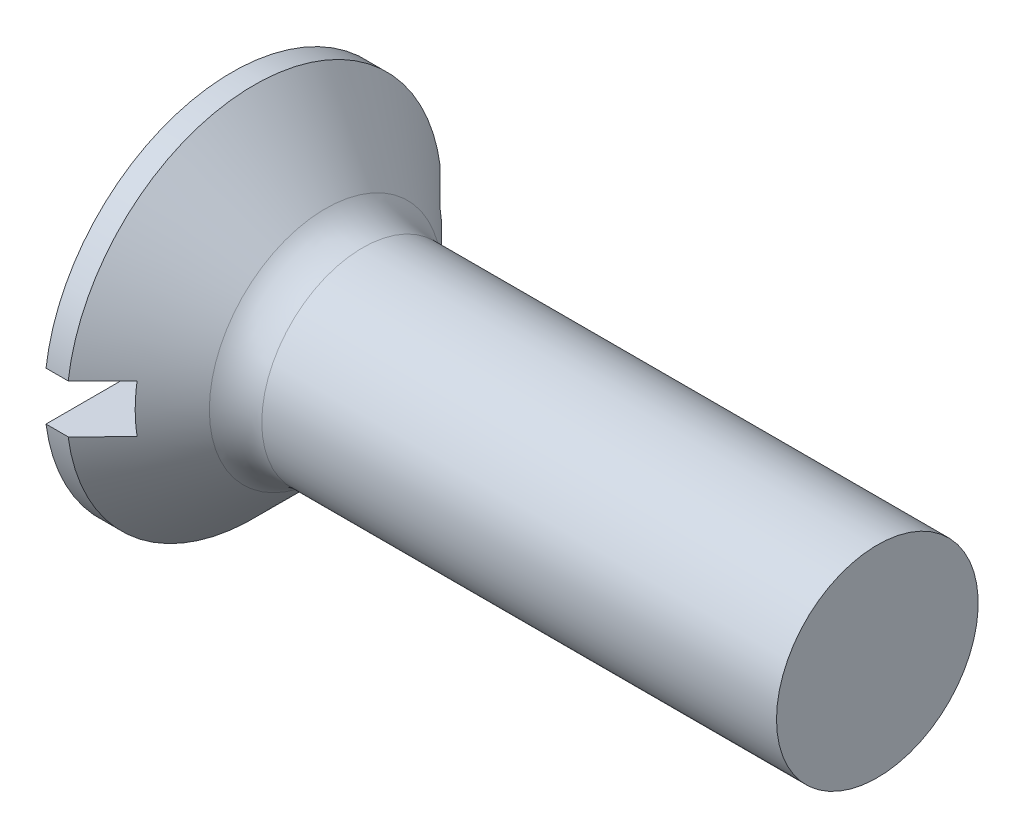
ISO-10303-21;
HEADER;
FILE_DESCRIPTION(('STEP AP214'),'2;1');
FILE_NAME('part.step','',(''),(''),'','','');
FILE_SCHEMA(('AUTOMOTIVE_DESIGN { 1 0 10303 214 1 1 1 1 }'));
ENDSEC;
DATA;
#1=APPLICATION_CONTEXT('core data for automotive mechanical design processes');
#2=APPLICATION_PROTOCOL_DEFINITION('international standard','automotive_design',2000,#1);
#3=PRODUCT_CONTEXT('',#1,'mechanical');
#4=PRODUCT('Part','Part','',(#3));
#5=PRODUCT_RELATED_PRODUCT_CATEGORY('part','',(#4));
#6=PRODUCT_DEFINITION_FORMATION('','',#4);
#7=PRODUCT_DEFINITION_CONTEXT('part definition',#1,'design');
#8=PRODUCT_DEFINITION('design','',#6,#7);
#9=PRODUCT_DEFINITION_SHAPE('','',#8);
#10=(LENGTH_UNIT() NAMED_UNIT(*) SI_UNIT(.MILLI.,.METRE.));
#11=(NAMED_UNIT(*) PLANE_ANGLE_UNIT() SI_UNIT($,.RADIAN.));
#12=(NAMED_UNIT(*) SI_UNIT($,.STERADIAN.) SOLID_ANGLE_UNIT());
#13=UNCERTAINTY_MEASURE_WITH_UNIT(LENGTH_MEASURE(1.E-05),#10,'distance_accuracy_value','');
#14=(GEOMETRIC_REPRESENTATION_CONTEXT(3) GLOBAL_UNCERTAINTY_ASSIGNED_CONTEXT((#13)) GLOBAL_UNIT_ASSIGNED_CONTEXT((#10,
#11,#12)) REPRESENTATION_CONTEXT('',''));
#15=CARTESIAN_POINT('',(0.,0.,0.));
#16=DIRECTION('',(0.,0.,1.));
#17=DIRECTION('',(1.,0.,0.));
#18=AXIS2_PLACEMENT_3D('',#15,#16,#17);
#19=CARTESIAN_POINT('',(-6.34999999999999,0.,0.));
#20=DIRECTION('',(-1.,0.,0.));
#21=DIRECTION('',(0.,0.,1.));
#22=AXIS2_PLACEMENT_3D('',#19,#20,#21);
#23=CYLINDRICAL_SURFACE('',#22,4.65);
#24=DIRECTION('',(-1.,0.,0.));
#25=VECTOR('',#24,1.);
#26=CARTESIAN_POINT('',(-6.34999999999999,0.599999999999999,-4.61112784468182));
#27=LINE('',#26,#25);
#28=CARTESIAN_POINT('',(0.,0.599999999999999,-4.61112784468182));
#29=VERTEX_POINT('',#28);
#30=CARTESIAN_POINT('',(0.550000000000009,0.599999999999999,-4.61112784468182));
#31=VERTEX_POINT('',#30);
#32=EDGE_CURVE('E53',#29,#31,#27,.F.);
#33=ORIENTED_EDGE('',*,*,#32,.F.);
#34=CARTESIAN_POINT('',(0.,0.,0.));
#35=DIRECTION('',(-1.,0.,0.));
#36=DIRECTION('',(0.,0.,1.));
#37=AXIS2_PLACEMENT_3D('',#34,#35,#36);
#38=CIRCLE('',#37,4.65);
#39=CARTESIAN_POINT('',(0.,0.600000000000001,4.61112784468182));
#40=VERTEX_POINT('',#39);
#41=EDGE_CURVE('E100',#40,#29,#38,.T.);
#42=ORIENTED_EDGE('',*,*,#41,.F.);
#43=DIRECTION('',(-1.,0.,0.));
#44=VECTOR('',#43,1.);
#45=CARTESIAN_POINT('',(-6.34999999999999,0.600000000000001,4.61112784468182));
#46=LINE('',#45,#44);
#47=CARTESIAN_POINT('',(0.550000000000009,0.600000000000001,4.61112784468182));
#48=VERTEX_POINT('',#47);
#49=EDGE_CURVE('E141',#48,#40,#46,.T.);
#50=ORIENTED_EDGE('',*,*,#49,.F.);
#51=CARTESIAN_POINT('',(0.550000000000008,0.,0.));
#52=DIRECTION('',(-1.,0.,0.));
#53=DIRECTION('',(0.,0.,1.));
#54=AXIS2_PLACEMENT_3D('',#51,#52,#53);
#55=CIRCLE('',#54,4.65);
#56=EDGE_CURVE('E109',#48,#31,#55,.T.);
#57=ORIENTED_EDGE('',*,*,#56,.T.);
#58=EDGE_LOOP('',(#33,#42,#50,#57));
#59=FACE_BOUND('',#58,.T.);
#60=ADVANCED_FACE('F30',(#59),#23,.T.);
#61=CARTESIAN_POINT('',(0.,0.,0.));
#62=DIRECTION('',(-1.,0.,0.));
#63=DIRECTION('',(0.,0.,1.));
#64=AXIS2_PLACEMENT_3D('',#61,#62,#63);
#65=PLANE('',#64);
#66=DIRECTION('',(0.,0.,-1.));
#67=VECTOR('',#66,1.);
#68=CARTESIAN_POINT('',(0.,0.6,0.));
#69=LINE('',#68,#67);
#70=EDGE_CURVE('E87',#40,#29,#69,.T.);
#71=ORIENTED_EDGE('',*,*,#70,.F.);
#72=ORIENTED_EDGE('',*,*,#41,.T.);
#73=EDGE_LOOP('',(#71,#72));
#74=FACE_BOUND('',#73,.T.);
#75=ADVANCED_FACE('F158',(#74),#65,.T.);
#76=CARTESIAN_POINT('',(16.,2.5,0.));
#77=DIRECTION('',(1.,0.,0.));
#78=DIRECTION('',(0.,0.,-1.));
#79=AXIS2_PLACEMENT_3D('',#76,#77,#78);
#80=PLANE('',#79);
#81=CARTESIAN_POINT('',(16.,0.,0.));
#82=DIRECTION('',(-1.,0.,0.));
#83=DIRECTION('',(0.,0.,1.));
#84=AXIS2_PLACEMENT_3D('',#81,#82,#83);
#85=CIRCLE('',#84,2.5);
#86=CARTESIAN_POINT('',(16.,0.,2.5));
#87=VERTEX_POINT('',#86);
#88=EDGE_CURVE('E110',#87,#87,#85,.T.);
#89=ORIENTED_EDGE('',*,*,#88,.F.);
#90=EDGE_LOOP('',(#89));
#91=FACE_BOUND('',#90,.T.);
#92=ADVANCED_FACE('F169',(#91),#80,.T.);
#93=CARTESIAN_POINT('',(-6.34999999999999,0.,0.));
#94=DIRECTION('',(-1.,0.,0.));
#95=DIRECTION('',(0.,0.,1.));
#96=AXIS2_PLACEMENT_3D('',#93,#94,#95);
#97=CYLINDRICAL_SURFACE('',#96,2.5);
#98=CARTESIAN_POINT('',(3.23847763108502,0.,0.));
#99=DIRECTION('',(-1.,0.,0.));
#100=DIRECTION('',(0.,0.,1.));
#101=AXIS2_PLACEMENT_3D('',#98,#99,#100);
#102=CIRCLE('',#101,2.5);
#103=CARTESIAN_POINT('',(3.23847763108502,0.,2.5));
#104=VERTEX_POINT('',#103);
#105=EDGE_CURVE('E88',#104,#104,#102,.F.);
#106=ORIENTED_EDGE('',*,*,#105,.T.);
#107=EDGE_LOOP('',(#106));
#108=FACE_BOUND('',#107,.T.);
#109=ORIENTED_EDGE('',*,*,#88,.T.);
#110=EDGE_LOOP('',(#109));
#111=FACE_BOUND('',#110,.T.);
#112=ADVANCED_FACE('F163',(#108,#111),#97,.T.);
#113=CARTESIAN_POINT('',(0.550000000000008,0.,0.));
#114=DIRECTION('',(-1.,0.,0.));
#115=DIRECTION('',(0.,0.,1.));
#116=AXIS2_PLACEMENT_3D('',#113,#114,#115);
#117=CONICAL_SURFACE('',#116,4.65,0.78539816339745);
#118=CARTESIAN_POINT('',(-5.05345798085363,0.599999999999999,-10.2358878738061));
#119=CARTESIAN_POINT('',(-4.7063338820772,0.599999999999999,-9.88816346765386));
#120=CARTESIAN_POINT('',(-4.35923588911081,0.599999999999999,-9.54041298783456));
#121=CARTESIAN_POINT('',(-3.66512028999245,0.599999999999999,-8.84482295341688));
#122=CARTESIAN_POINT('',(-3.31810268492325,0.599999999999999,-8.49698339773806));
#123=CARTESIAN_POINT('',(-2.6240861085145,0.599999999999999,-7.80108810044584));
#124=CARTESIAN_POINT('',(-2.27708717061556,0.599999999999999,-7.45303232547742));
#125=CARTESIAN_POINT('',(-1.58327190960451,0.599999999999999,-6.75674744401148));
#126=CARTESIAN_POINT('',(-1.23645558427177,0.599999999999999,-6.40851833972678));
#127=CARTESIAN_POINT('',(-0.530234288880172,0.599999999999999,-5.69884909860564));
#128=CARTESIAN_POINT('',(-0.170839920396744,0.599999999999999,-5.3373984063476));
#129=CARTESIAN_POINT('',(0.367846499606966,0.599999999999999,-4.79480605507249));
#130=CARTESIAN_POINT('',(0.547344617567889,0.599999999999999,-4.61386901631146));
#131=CARTESIAN_POINT('',(0.906142780462514,0.599999999999999,-4.251800035553));
#132=CARTESIAN_POINT('',(1.08544282617177,0.6,-4.07066809432422));
#133=CARTESIAN_POINT('',(1.44372217573977,0.6,-3.70815209675441));
#134=CARTESIAN_POINT('',(1.62270153193744,0.6,-3.52676809217752));
#135=CARTESIAN_POINT('',(1.98021132361776,0.6,-3.16355280067778));
#136=CARTESIAN_POINT('',(2.1587417523097,0.6,-2.98172150707033));
#137=CARTESIAN_POINT('',(2.51504600954838,0.6,-2.61734150295503));
#138=CARTESIAN_POINT('',(2.69281988935326,0.6,-2.43479284271594));
#139=CARTESIAN_POINT('',(2.95840184240507,0.6,-2.15993102072038));
#140=CARTESIAN_POINT('',(3.0467482793297,0.6,-2.06813839931134));
#141=CARTESIAN_POINT('',(3.22290791170148,0.6,-1.8840432741785));
#142=CARTESIAN_POINT('',(3.31072111192471,0.6,-1.79174077503573));
#143=CARTESIAN_POINT('',(3.44507973379147,0.6,-1.64924720242533));
#144=CARTESIAN_POINT('',(3.49191887004633,0.6,-1.59933324859849));
#145=CARTESIAN_POINT('',(3.58528403723339,0.6,-1.49921165532858));
#146=CARTESIAN_POINT('',(3.63181006313953,0.6,-1.44900401119525));
#147=CARTESIAN_POINT('',(3.72427703260543,0.6,-1.348388660684));
#148=CARTESIAN_POINT('',(3.77021949037902,0.6,-1.29798234998229));
#149=CARTESIAN_POINT('',(3.86152904277955,0.6,-1.19665513561933));
#150=CARTESIAN_POINT('',(3.90689615796224,0.6,-1.1457342504602));
#151=CARTESIAN_POINT('',(4.01209252723327,0.6,-1.02578570206612));
#152=CARTESIAN_POINT('',(4.07160553566885,0.6,-0.956477036268248));
#153=CARTESIAN_POINT('',(4.15917887607317,0.6,-0.850702358470614));
#154=CARTESIAN_POINT('',(4.18818199499264,0.6,-0.815019024045419));
#155=CARTESIAN_POINT('',(4.24528795110788,0.6,-0.742941326145326));
#156=CARTESIAN_POINT('',(4.27339088381092,0.6,-0.706547038764568));
#157=CARTESIAN_POINT('',(4.32869682497791,0.6,-0.632291545018036));
#158=CARTESIAN_POINT('',(4.35588213575686,0.6,-0.594417046382877));
#159=CARTESIAN_POINT('',(4.40832254729278,0.6,-0.517260214202537));
#160=CARTESIAN_POINT('',(4.43357498481566,0.6,-0.477976043956169));
#161=CARTESIAN_POINT('',(4.48075024121382,0.6,-0.397940392744046));
#162=CARTESIAN_POINT('',(4.50270366327433,0.6,-0.357207379701578));
#163=CARTESIAN_POINT('',(4.54164745720656,0.6,-0.273493725174854));
#164=CARTESIAN_POINT('',(4.55865364653391,0.6,-0.230520776744234));
#165=CARTESIAN_POINT('',(4.58372379462179,0.6,-0.145820085871145));
#166=CARTESIAN_POINT('',(4.59242377597666,0.6,-0.104295783748555));
#167=CARTESIAN_POINT('',(4.59893532241227,0.6,-0.0414391937715873));
#168=CARTESIAN_POINT('',(4.60002000613735,0.6,-0.0204304556953828));
#169=CARTESIAN_POINT('',(4.59997943950967,0.6,0.0215839024601797));
#170=CARTESIAN_POINT('',(4.59885411345371,0.6,0.0425895224080776));
#171=CARTESIAN_POINT('',(4.59227145283522,0.6,0.10501520512154));
#172=CARTESIAN_POINT('',(4.58363501258282,0.6,0.1461245792122));
#173=CARTESIAN_POINT('',(4.565808560724,0.6,0.206345557501641));
#174=CARTESIAN_POINT('',(4.55901965609655,0.6,0.226250715937573));
#175=CARTESIAN_POINT('',(4.54410905338993,0.6,0.265557322006364));
#176=CARTESIAN_POINT('',(4.53598757591988,0.6,0.284958852400758));
#177=CARTESIAN_POINT('',(4.51162458134292,0.6,0.33886087793319));
#178=CARTESIAN_POINT('',(4.49415337187064,0.6,0.372800556957469));
#179=CARTESIAN_POINT('',(4.45684225886175,0.6,0.439365473741557));
#180=CARTESIAN_POINT('',(4.436999696206,0.6,0.471989179975825));
#181=CARTESIAN_POINT('',(4.39563171221961,0.6,0.53629862960031));
#182=CARTESIAN_POINT('',(4.37410080185607,0.6,0.567980809264081));
#183=CARTESIAN_POINT('',(4.32989042558404,0.6,0.630537340732858));
#184=CARTESIAN_POINT('',(4.30721068113902,0.6,0.661411493852085));
#185=CARTESIAN_POINT('',(4.23751211011742,0.6,0.753681353138898));
#186=CARTESIAN_POINT('',(4.18923822306601,0.6,0.814124888465015));
#187=CARTESIAN_POINT('',(4.0909576629573,0.6,0.933321700638784));
#188=CARTESIAN_POINT('',(4.04095530157681,0.6,0.992078596429101));
#189=CARTESIAN_POINT('',(3.94086297328448,0.6,1.10735067105448));
#190=CARTESIAN_POINT('',(3.89079728066038,0.6,1.16388697288741));
#191=CARTESIAN_POINT('',(3.78992367247538,0.6,1.27629304811311));
#192=CARTESIAN_POINT('',(3.73911573838906,0.6,1.33216280480632));
#193=CARTESIAN_POINT('',(3.58591315191241,0.6,1.49908452635045));
#194=CARTESIAN_POINT('',(3.4827535526898,0.6,1.609433299801));
#195=CARTESIAN_POINT('',(3.27521830235561,0.6,1.82922471356774));
#196=CARTESIAN_POINT('',(3.17084134295835,0.6,1.93866611055463));
#197=CARTESIAN_POINT('',(2.96141984922221,0.6,2.15689179192462));
#198=CARTESIAN_POINT('',(2.85637536705428,0.6,2.26567612639587));
#199=CARTESIAN_POINT('',(2.64692360208389,0.6,2.481710644307));
#200=CARTESIAN_POINT('',(2.5425207690165,0.6,2.58896514889977));
#201=CARTESIAN_POINT('',(2.33341496587689,0.6,2.80318525747577));
#202=CARTESIAN_POINT('',(2.22871198983414,0.6,2.91015085562864));
#203=CARTESIAN_POINT('',(1.91438863951787,0.6,3.23063427951565));
#204=CARTESIAN_POINT('',(1.70445280610493,0.6,3.44384256715819));
#205=CARTESIAN_POINT('',(1.22510768237795,0.6,3.9295930523411));
#206=CARTESIAN_POINT('',(0.955548928391404,0.600000000000001,4.20198758385551));
#207=CARTESIAN_POINT('',(0.416004890581452,0.600000000000001,4.74635530428132));
#208=CARTESIAN_POINT('',(0.146019605475206,0.600000000000001,5.01832849192059));
#209=CARTESIAN_POINT('',(-0.664426807694015,0.600000000000001,5.83398149060914));
#210=CARTESIAN_POINT('',(-1.2052682118604,0.600000000000001,6.37728333249965));
#211=CARTESIAN_POINT('',(-2.297244515822,0.600000000000001,7.47334328359636));
#212=CARTESIAN_POINT('',(-2.84838746103815,0.600000000000001,8.02609337109331));
#213=CARTESIAN_POINT('',(-3.95082527410524,0.600000000000001,9.1312059158983));
#214=CARTESIAN_POINT('',(-4.5021200841492,0.600000000000001,9.683568430867));
#215=CARTESIAN_POINT('',(-5.05345798085363,0.600000000000001,10.2358878738061));
#216=B_SPLINE_CURVE_WITH_KNOTS('',3,(#118,#119,#120,#121,#122,#123,#124,#125,#126,#127,#128,
#129,#130,#131,#132,#133,#134,#135,#136,#137,#138,#139,#140,#141,#142,#143,#144,#145,#146,#147,
#148,#149,#150,#151,#152,#153,#154,#155,#156,#157,#158,#159,#160,#161,#162,#163,#164,#165,#166,
#167,#168,#169,#170,#171,#172,#173,#174,#175,#176,#177,#178,#179,#180,#181,#182,#183,#184,#185,
#186,#187,#188,#189,#190,#191,#192,#193,#194,#195,#196,#197,#198,#199,#200,#201,#202,#203,#204,
#205,#206,#207,#208,#209,#210,#211,#212,#213,#214,#215),.UNSPECIFIED.,.F.,.F.,(4,2,2,2,2,2,2,2,
2,2,2,2,2,2,2,2,2,2,2,2,2,2,2,2,2,2,2,2,2,2,2,2,2,2,2,2,2,2,2,2,2,2,2,2,2,2,2,2,4),(0.,
1.47399683090689,2.94801247877137,4.4224478361575,5.89686482953469,7.42601395143836,
8.19061836510007,8.95521977425755,9.71968231604465,10.4841563527515,11.2485777423704,
11.630779125471,12.0129770802189,12.2183239645211,12.4236741372326,12.6282760301194,
12.8328705923058,13.1068888942381,13.2448295456087,13.3827555130536,13.522578829549,
13.6625914591711,13.8012122737476,13.9393848876123,14.0658401529418,14.1288404679688,
14.1918429410897,14.3170190368162,14.3800826362346,14.4431358059084,14.557498941854,
14.6719915440135,14.7868731764568,14.9017827966977,15.1337679990585,15.365211229124,
15.5917537379438,15.8183019106741,16.2714608987008,16.7251625423049,17.1788291521206,
17.6278622396792,18.076904322379,18.9745538574966,20.1242253982686,21.2739004034116,
23.5737206872119,25.9154338775763,28.2566456069255),.UNSPECIFIED.);
#217=CARTESIAN_POINT('',(1.4,0.6,3.75233260785875));
#218=VERTEX_POINT('',#217);
#219=EDGE_CURVE('E105',#218,#48,#216,.T.);
#220=ORIENTED_EDGE('',*,*,#219,.F.);
#221=CARTESIAN_POINT('',(1.4,0.,0.));
#222=DIRECTION('',(1.,0.,0.));
#223=DIRECTION('',(0.,0.,-1.));
#224=AXIS2_PLACEMENT_3D('',#221,#222,#223);
#225=CIRCLE('',#224,3.80000000000001);
#226=CARTESIAN_POINT('',(1.4,-0.600000000000001,3.75233260785875));
#227=VERTEX_POINT('',#226);
#228=EDGE_CURVE('E11',#227,#218,#225,.F.);
#229=ORIENTED_EDGE('',*,*,#228,.F.);
#230=CARTESIAN_POINT('',(-5.05345798085363,-0.600000000000001,10.2358878738061));
#231=CARTESIAN_POINT('',(-4.7063338820772,-0.600000000000001,9.88816346765386));
#232=CARTESIAN_POINT('',(-4.35923588911081,-0.600000000000001,9.54041298783456));
#233=CARTESIAN_POINT('',(-3.66512028999245,-0.600000000000001,8.84482295341688));
#234=CARTESIAN_POINT('',(-3.31810268492326,-0.600000000000001,8.49698339773806));
#235=CARTESIAN_POINT('',(-2.6240861085145,-0.600000000000001,7.80108810044584));
#236=CARTESIAN_POINT('',(-2.27708717061556,-0.600000000000001,7.45303232547743));
#237=CARTESIAN_POINT('',(-1.58327190960451,-0.600000000000001,6.75674744401148));
#238=CARTESIAN_POINT('',(-1.23645558427177,-0.600000000000001,6.40851833972678));
#239=CARTESIAN_POINT('',(-0.530234288880173,-0.600000000000001,5.69884909860564));
#240=CARTESIAN_POINT('',(-0.170839920396744,-0.600000000000001,5.3373984063476));
#241=CARTESIAN_POINT('',(0.367846499606967,-0.600000000000001,4.79480605507248));
#242=CARTESIAN_POINT('',(0.547344617567889,-0.600000000000001,4.61386901631146));
#243=CARTESIAN_POINT('',(0.906142780462514,-0.600000000000001,4.251800035553));
#244=CARTESIAN_POINT('',(1.08544282617177,-0.600000000000001,4.07066809432422));
#245=CARTESIAN_POINT('',(1.44372217573977,-0.600000000000001,3.70815209675441));
#246=CARTESIAN_POINT('',(1.62270153193744,-0.600000000000001,3.52676809217752));
#247=CARTESIAN_POINT('',(1.98021132361776,-0.600000000000001,3.16355280067778));
#248=CARTESIAN_POINT('',(2.1587417523097,-0.600000000000001,2.98172150707033));
#249=CARTESIAN_POINT('',(2.51504600954839,-0.600000000000001,2.61734150295503));
#250=CARTESIAN_POINT('',(2.69281988935326,-0.600000000000001,2.43479284271593));
#251=CARTESIAN_POINT('',(2.95840184240507,-0.600000000000001,2.15993102072038));
#252=CARTESIAN_POINT('',(3.0467482793297,-0.600000000000001,2.06813839931134));
#253=CARTESIAN_POINT('',(3.22290791170148,-0.600000000000001,1.8840432741785));
#254=CARTESIAN_POINT('',(3.31072111192471,-0.600000000000001,1.79174077503573));
#255=CARTESIAN_POINT('',(3.44507973379147,-0.600000000000001,1.64924720242533));
#256=CARTESIAN_POINT('',(3.49191887004633,-0.600000000000001,1.59933324859849));
#257=CARTESIAN_POINT('',(3.58528403723339,-0.600000000000001,1.49921165532858));
#258=CARTESIAN_POINT('',(3.63181006313953,-0.600000000000001,1.44900401119525));
#259=CARTESIAN_POINT('',(3.72427703260543,-0.600000000000001,1.348388660684));
#260=CARTESIAN_POINT('',(3.77021949037902,-0.600000000000001,1.29798234998228));
#261=CARTESIAN_POINT('',(3.86152904277955,-0.600000000000001,1.19665513561933));
#262=CARTESIAN_POINT('',(3.90689615796224,-0.600000000000001,1.1457342504602));
#263=CARTESIAN_POINT('',(4.01209252723327,-0.600000000000001,1.02578570206612));
#264=CARTESIAN_POINT('',(4.07160553566885,-0.600000000000001,0.956477036268246));
#265=CARTESIAN_POINT('',(4.15917887607317,-0.600000000000001,0.850702358470612));
#266=CARTESIAN_POINT('',(4.18818199499264,-0.600000000000001,0.815019024045418));
#267=CARTESIAN_POINT('',(4.24528795110788,-0.600000000000001,0.742941326145326));
#268=CARTESIAN_POINT('',(4.27339088381092,-0.600000000000001,0.706547038764567));
#269=CARTESIAN_POINT('',(4.32869682497791,-0.600000000000001,0.632291545018035));
#270=CARTESIAN_POINT('',(4.35588213575686,-0.600000000000001,0.594417046382876));
#271=CARTESIAN_POINT('',(4.40832254729278,-0.600000000000001,0.517260214202537));
#272=CARTESIAN_POINT('',(4.43357498481566,-0.600000000000001,0.477976043956169));
#273=CARTESIAN_POINT('',(4.48075024121381,-0.600000000000001,0.397940392744045));
#274=CARTESIAN_POINT('',(4.50270366327432,-0.600000000000001,0.357207379701577));
#275=CARTESIAN_POINT('',(4.54164745720656,-0.600000000000001,0.273493725174853));
#276=CARTESIAN_POINT('',(4.55865364653391,-0.600000000000001,0.230520776744233));
#277=CARTESIAN_POINT('',(4.58372379462179,-0.600000000000001,0.145820085871143));
#278=CARTESIAN_POINT('',(4.59242377597666,-0.600000000000001,0.104295783748554));
#279=CARTESIAN_POINT('',(4.59893532241227,-0.600000000000001,0.0414391937715857));
#280=CARTESIAN_POINT('',(4.60002000613735,-0.600000000000001,0.0204304556953811));
#281=CARTESIAN_POINT('',(4.59997943950967,-0.600000000000001,-0.0215839024601813));
#282=CARTESIAN_POINT('',(4.59885411345371,-0.600000000000001,-0.0425895224080792));
#283=CARTESIAN_POINT('',(4.59227145283522,-0.600000000000001,-0.105015205121542));
#284=CARTESIAN_POINT('',(4.58363501258282,-0.600000000000001,-0.146124579212202));
#285=CARTESIAN_POINT('',(4.565808560724,-0.600000000000001,-0.206345557501643));
#286=CARTESIAN_POINT('',(4.55901965609655,-0.600000000000001,-0.226250715937575));
#287=CARTESIAN_POINT('',(4.54410905338993,-0.600000000000001,-0.265557322006366));
#288=CARTESIAN_POINT('',(4.53598757591988,-0.600000000000001,-0.284958852400759));
#289=CARTESIAN_POINT('',(4.51162458134292,-0.600000000000001,-0.338860877933191));
#290=CARTESIAN_POINT('',(4.49415337187063,-0.600000000000001,-0.37280055695747));
#291=CARTESIAN_POINT('',(4.45684225886175,-0.600000000000001,-0.439365473741559));
#292=CARTESIAN_POINT('',(4.43699969620599,-0.600000000000001,-0.471989179975827));
#293=CARTESIAN_POINT('',(4.3956317122196,-0.600000000000001,-0.536298629600312));
#294=CARTESIAN_POINT('',(4.37410080185606,-0.600000000000001,-0.567980809264084));
#295=CARTESIAN_POINT('',(4.32989042558404,-0.600000000000001,-0.630537340732861));
#296=CARTESIAN_POINT('',(4.30721068113901,-0.600000000000001,-0.661411493852087));
#297=CARTESIAN_POINT('',(4.23751211011741,-0.600000000000001,-0.753681353138901));
#298=CARTESIAN_POINT('',(4.18923822306601,-0.600000000000001,-0.814124888465019));
#299=CARTESIAN_POINT('',(4.09095766295729,-0.600000000000001,-0.933321700638789));
#300=CARTESIAN_POINT('',(4.04095530157681,-0.600000000000001,-0.992078596429106));
#301=CARTESIAN_POINT('',(3.94086297328448,-0.600000000000001,-1.10735067105449));
#302=CARTESIAN_POINT('',(3.89079728066037,-0.600000000000001,-1.16388697288741));
#303=CARTESIAN_POINT('',(3.78992367247537,-0.600000000000001,-1.27629304811312));
#304=CARTESIAN_POINT('',(3.73911573838905,-0.600000000000001,-1.33216280480632));
#305=CARTESIAN_POINT('',(3.5859131519124,-0.600000000000001,-1.49908452635046));
#306=CARTESIAN_POINT('',(3.48275355268979,-0.600000000000001,-1.60943329980101));
#307=CARTESIAN_POINT('',(3.2752183023556,-0.600000000000001,-1.82922471356774));
#308=CARTESIAN_POINT('',(3.17084134295834,-0.600000000000001,-1.93866611055464));
#309=CARTESIAN_POINT('',(2.9614198492222,-0.600000000000001,-2.15689179192463));
#310=CARTESIAN_POINT('',(2.85637536705427,-0.600000000000001,-2.26567612639588));
#311=CARTESIAN_POINT('',(2.64692360208387,-0.600000000000001,-2.48171064430701));
#312=CARTESIAN_POINT('',(2.54252076901648,-0.600000000000001,-2.58896514889978));
#313=CARTESIAN_POINT('',(2.33341496587687,-0.600000000000001,-2.80318525747579));
#314=CARTESIAN_POINT('',(2.22871198983412,-0.600000000000001,-2.91015085562866));
#315=CARTESIAN_POINT('',(1.91438863951785,-0.600000000000001,-3.23063427951567));
#316=CARTESIAN_POINT('',(1.70445280610491,-0.600000000000001,-3.44384256715821));
#317=CARTESIAN_POINT('',(1.22510768237793,-0.600000000000001,-3.92959305234112));
#318=CARTESIAN_POINT('',(0.955548928391384,-0.600000000000001,-4.20198758385553));
#319=CARTESIAN_POINT('',(0.416004890581434,-0.600000000000001,-4.74635530428134));
#320=CARTESIAN_POINT('',(0.146019605475189,-0.600000000000001,-5.01832849192061));
#321=CARTESIAN_POINT('',(-0.66442680769403,-0.600000000000001,-5.83398149060916));
#322=CARTESIAN_POINT('',(-1.20526821186041,-0.600000000000001,-6.37728333249967));
#323=CARTESIAN_POINT('',(-2.29724451582201,-0.600000000000001,-7.47334328359637));
#324=CARTESIAN_POINT('',(-2.84838746103816,-0.600000000000001,-8.02609337109332));
#325=CARTESIAN_POINT('',(-3.95082527410525,-0.600000000000001,-9.13120591589831));
#326=CARTESIAN_POINT('',(-4.5021200841492,-0.600000000000001,-9.68356843086701));
#327=CARTESIAN_POINT('',(-5.05345798085363,-0.600000000000001,-10.2358878738061));
#328=B_SPLINE_CURVE_WITH_KNOTS('',3,(#230,#231,#232,#233,#234,#235,#236,#237,#238,#239,#240,
#241,#242,#243,#244,#245,#246,#247,#248,#249,#250,#251,#252,#253,#254,#255,#256,#257,#258,#259,
#260,#261,#262,#263,#264,#265,#266,#267,#268,#269,#270,#271,#272,#273,#274,#275,#276,#277,#278,
#279,#280,#281,#282,#283,#284,#285,#286,#287,#288,#289,#290,#291,#292,#293,#294,#295,#296,#297,
#298,#299,#300,#301,#302,#303,#304,#305,#306,#307,#308,#309,#310,#311,#312,#313,#314,#315,#316,
#317,#318,#319,#320,#321,#322,#323,#324,#325,#326,#327),.UNSPECIFIED.,.F.,.F.,(4,2,2,2,2,2,2,2,
2,2,2,2,2,2,2,2,2,2,2,2,2,2,2,2,2,2,2,2,2,2,2,2,2,2,2,2,2,2,2,2,2,2,2,2,2,2,2,2,4),(0.,
1.47399683090689,2.94801247877137,4.4224478361575,5.89686482953469,7.42601395143836,
8.19061836510007,8.95521977425755,9.71968231604465,10.4841563527515,11.2485777423704,
11.630779125471,12.0129770802189,12.2183239645211,12.4236741372326,12.6282760301194,
12.8328705923058,13.1068888942381,13.2448295456087,13.3827555130536,13.522578829549,
13.6625914591711,13.8012122737476,13.9393848876123,14.0658401529418,14.1288404679688,
14.1918429410897,14.3170190368162,14.3800826362346,14.4431358059084,14.557498941854,
14.6719915440135,14.7868731764568,14.9017827966977,15.1337679990585,15.365211229124,
15.5917537379438,15.8183019106741,16.2714608987008,16.7251625423049,17.1788291521206,
17.6278622396792,18.076904322379,18.9745538574966,20.1242253982686,21.2739004034116,
23.5737206872119,25.9154338775763,28.2566456069255),.UNSPECIFIED.);
#329=CARTESIAN_POINT('',(0.550000000000009,-0.600000000000001,4.61112784468182));
#330=VERTEX_POINT('',#329);
#331=EDGE_CURVE('E96',#330,#227,#328,.T.);
#332=ORIENTED_EDGE('',*,*,#331,.F.);
#333=CARTESIAN_POINT('',(0.550000000000009,-0.600000000000001,-4.61112784468182));
#334=VERTEX_POINT('',#333);
#335=EDGE_CURVE('E95',#334,#330,#55,.T.);
#336=ORIENTED_EDGE('',*,*,#335,.F.);
#337=CARTESIAN_POINT('',(1.4,-0.600000000000001,-3.75233260785875));
#338=VERTEX_POINT('',#337);
#339=EDGE_CURVE('E97',#338,#334,#328,.T.);
#340=ORIENTED_EDGE('',*,*,#339,.F.);
#341=CARTESIAN_POINT('',(1.4,0.6,-3.75233260785875));
#342=VERTEX_POINT('',#341);
#343=EDGE_CURVE('E34',#342,#338,#225,.F.);
#344=ORIENTED_EDGE('',*,*,#343,.F.);
#345=EDGE_CURVE('E101',#31,#342,#216,.T.);
#346=ORIENTED_EDGE('',*,*,#345,.F.);
#347=ORIENTED_EDGE('',*,*,#56,.F.);
#348=EDGE_LOOP('',(#220,#229,#332,#336,#340,#344,#346,#347));
#349=FACE_BOUND('',#348,.T.);
#350=CARTESIAN_POINT('',(2.31923881554251,0.,0.));
#351=DIRECTION('',(-1.,0.,0.));
#352=DIRECTION('',(0.,0.,1.));
#353=AXIS2_PLACEMENT_3D('',#350,#351,#352);
#354=CIRCLE('',#353,2.88076118445749);
#355=CARTESIAN_POINT('',(2.31923881554251,0.,2.88076118445749));
#356=VERTEX_POINT('',#355);
#357=EDGE_CURVE('E113',#356,#356,#354,.T.);
#358=ORIENTED_EDGE('',*,*,#357,.T.);
#359=EDGE_LOOP('',(#358));
#360=FACE_BOUND('',#359,.T.);
#361=ADVANCED_FACE('F132',(#349,#360),#117,.T.);
#362=DIRECTION('',(-1.,0.,0.));
#363=VECTOR('',#362,1.);
#364=CARTESIAN_POINT('',(-6.34999999999999,-0.600000000000001,4.61112784468182));
#365=LINE('',#364,#363);
#366=CARTESIAN_POINT('',(0.,-0.600000000000001,4.61112784468182));
#367=VERTEX_POINT('',#366);
#368=EDGE_CURVE('E82',#367,#330,#365,.F.);
#369=ORIENTED_EDGE('',*,*,#368,.F.);
#370=CARTESIAN_POINT('',(0.,-0.600000000000001,-4.61112784468182));
#371=VERTEX_POINT('',#370);
#372=EDGE_CURVE('E93',#371,#367,#38,.T.);
#373=ORIENTED_EDGE('',*,*,#372,.F.);
#374=DIRECTION('',(-1.,0.,0.));
#375=VECTOR('',#374,1.);
#376=CARTESIAN_POINT('',(-6.34999999999999,-0.600000000000001,-4.61112784468182));
#377=LINE('',#376,#375);
#378=EDGE_CURVE('E45',#334,#371,#377,.T.);
#379=ORIENTED_EDGE('',*,*,#378,.F.);
#380=ORIENTED_EDGE('',*,*,#335,.T.);
#381=EDGE_LOOP('',(#369,#373,#379,#380));
#382=FACE_BOUND('',#381,.T.);
#383=ADVANCED_FACE('F92',(#382),#23,.T.);
#384=DIRECTION('',(0.,0.,1.));
#385=VECTOR('',#384,1.);
#386=CARTESIAN_POINT('',(0.,-0.600000000000001,0.));
#387=LINE('',#386,#385);
#388=EDGE_CURVE('E79',#371,#367,#387,.T.);
#389=ORIENTED_EDGE('',*,*,#388,.F.);
#390=ORIENTED_EDGE('',*,*,#372,.T.);
#391=EDGE_LOOP('',(#389,#390));
#392=FACE_BOUND('',#391,.T.);
#393=ADVANCED_FACE('F99',(#392),#65,.T.);
#394=CARTESIAN_POINT('',(3.23847763108503,0.,0.));
#395=DIRECTION('',(-1.,0.,0.));
#396=DIRECTION('',(0.,0.,1.));
#397=AXIS2_PLACEMENT_3D('',#394,#395,#396);
#398=TOROIDAL_SURFACE('',#397,3.8,1.3);
#399=ORIENTED_EDGE('',*,*,#105,.F.);
#400=EDGE_LOOP('',(#399));
#401=FACE_BOUND('',#400,.T.);
#402=ORIENTED_EDGE('',*,*,#357,.F.);
#403=EDGE_LOOP('',(#402));
#404=FACE_BOUND('',#403,.T.);
#405=ADVANCED_FACE('F32',(#401,#404),#398,.F.);
#406=CARTESIAN_POINT('',(1.4,0.600000000000001,4.65));
#407=DIRECTION('',(0.,1.,0.));
#408=DIRECTION('',(0.,0.,1.));
#409=AXIS2_PLACEMENT_3D('',#406,#407,#408);
#410=PLANE('',#409);
#411=ORIENTED_EDGE('',*,*,#345,.T.);
#412=DIRECTION('',(0.,0.,-1.));
#413=VECTOR('',#412,1.);
#414=CARTESIAN_POINT('',(1.4,0.600000000000001,4.65));
#415=LINE('',#414,#413);
#416=EDGE_CURVE('E127',#218,#342,#415,.T.);
#417=ORIENTED_EDGE('',*,*,#416,.F.);
#418=ORIENTED_EDGE('',*,*,#219,.T.);
#419=ORIENTED_EDGE('',*,*,#49,.T.);
#420=ORIENTED_EDGE('',*,*,#70,.T.);
#421=ORIENTED_EDGE('',*,*,#32,.T.);
#422=EDGE_LOOP('',(#411,#417,#418,#419,#420,#421));
#423=FACE_BOUND('',#422,.T.);
#424=ADVANCED_FACE('F151',(#423),#410,.F.);
#425=CARTESIAN_POINT('',(1.4,-0.600000000000001,-4.65));
#426=DIRECTION('',(0.,-1.,0.));
#427=DIRECTION('',(0.,0.,-1.));
#428=AXIS2_PLACEMENT_3D('',#425,#426,#427);
#429=PLANE('',#428);
#430=ORIENTED_EDGE('',*,*,#331,.T.);
#431=DIRECTION('',(0.,0.,1.));
#432=VECTOR('',#431,1.);
#433=CARTESIAN_POINT('',(1.4,-0.600000000000001,-4.65));
#434=LINE('',#433,#432);
#435=EDGE_CURVE('E124',#338,#227,#434,.T.);
#436=ORIENTED_EDGE('',*,*,#435,.F.);
#437=ORIENTED_EDGE('',*,*,#339,.T.);
#438=ORIENTED_EDGE('',*,*,#378,.T.);
#439=ORIENTED_EDGE('',*,*,#388,.T.);
#440=ORIENTED_EDGE('',*,*,#368,.T.);
#441=EDGE_LOOP('',(#430,#436,#437,#438,#439,#440));
#442=FACE_BOUND('',#441,.T.);
#443=ADVANCED_FACE('F81',(#442),#429,.F.);
#444=CARTESIAN_POINT('',(1.4,-0.600000000000001,-4.65));
#445=DIRECTION('',(1.,0.,0.));
#446=DIRECTION('',(0.,0.,-1.));
#447=AXIS2_PLACEMENT_3D('',#444,#445,#446);
#448=PLANE('',#447);
#449=ORIENTED_EDGE('',*,*,#228,.T.);
#450=ORIENTED_EDGE('',*,*,#416,.T.);
#451=ORIENTED_EDGE('',*,*,#343,.T.);
#452=ORIENTED_EDGE('',*,*,#435,.T.);
#453=EDGE_LOOP('',(#449,#450,#451,#452));
#454=FACE_BOUND('',#453,.T.);
#455=ADVANCED_FACE('F123',(#454),#448,.F.);
#456=CLOSED_SHELL('',(#60,#75,#92,#112,#361,#383,#393,#405,#424,#443,#455));
#457=MANIFOLD_SOLID_BREP('B2',#456);
#458=ADVANCED_BREP_SHAPE_REPRESENTATION('',(#18,#457),#14);
#459=SHAPE_DEFINITION_REPRESENTATION(#9,#458);
ENDSEC;
END-ISO-10303-21;
